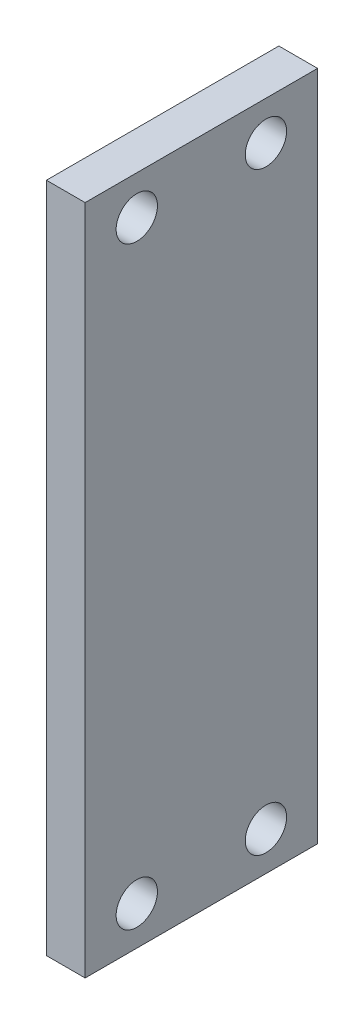
ISO-10303-21;
HEADER;
FILE_DESCRIPTION(('STEP AP214'),'2;1');
FILE_NAME('part.step','',(''),(''),'','','');
FILE_SCHEMA(('AUTOMOTIVE_DESIGN { 1 0 10303 214 1 1 1 1 }'));
ENDSEC;
DATA;
#1=APPLICATION_CONTEXT('core data for automotive mechanical design processes');
#2=APPLICATION_PROTOCOL_DEFINITION('international standard','automotive_design',2000,#1);
#3=PRODUCT_CONTEXT('',#1,'mechanical');
#4=PRODUCT('Part','Part','',(#3));
#5=PRODUCT_RELATED_PRODUCT_CATEGORY('part','',(#4));
#6=PRODUCT_DEFINITION_FORMATION('','',#4);
#7=PRODUCT_DEFINITION_CONTEXT('part definition',#1,'design');
#8=PRODUCT_DEFINITION('design','',#6,#7);
#9=PRODUCT_DEFINITION_SHAPE('','',#8);
#10=(LENGTH_UNIT() NAMED_UNIT(*) SI_UNIT(.MILLI.,.METRE.));
#11=(NAMED_UNIT(*) PLANE_ANGLE_UNIT() SI_UNIT($,.RADIAN.));
#12=(NAMED_UNIT(*) SI_UNIT($,.STERADIAN.) SOLID_ANGLE_UNIT());
#13=UNCERTAINTY_MEASURE_WITH_UNIT(LENGTH_MEASURE(1.E-05),#10,'distance_accuracy_value','');
#14=(GEOMETRIC_REPRESENTATION_CONTEXT(3) GLOBAL_UNCERTAINTY_ASSIGNED_CONTEXT((#13)) GLOBAL_UNIT_ASSIGNED_CONTEXT((#10,
#11,#12)) REPRESENTATION_CONTEXT('',''));
#15=CARTESIAN_POINT('',(0.,0.,0.));
#16=DIRECTION('',(0.,0.,1.));
#17=DIRECTION('',(1.,0.,0.));
#18=AXIS2_PLACEMENT_3D('',#15,#16,#17);
#19=CARTESIAN_POINT('',(123.988696823,-49.005118759,19.));
#20=DIRECTION('',(0.,0.,1.));
#21=DIRECTION('',(1.,0.,0.));
#22=AXIS2_PLACEMENT_3D('',#19,#20,#21);
#23=PLANE('',#22);
#24=DIRECTION('',(0.,1.,0.));
#25=VECTOR('',#24,1.);
#26=CARTESIAN_POINT('',(120.988696823,-75.005118759,19.));
#27=LINE('',#26,#25);
#28=CARTESIAN_POINT('',(120.988696823,-75.005118759,19.));
#29=VERTEX_POINT('',#28);
#30=CARTESIAN_POINT('',(120.988696823,-23.005118759,19.));
#31=VERTEX_POINT('',#30);
#32=EDGE_CURVE('E11',#29,#31,#27,.T.);
#33=ORIENTED_EDGE('',*,*,#32,.T.);
#34=DIRECTION('',(-1.,0.,0.));
#35=VECTOR('',#34,1.);
#36=CARTESIAN_POINT('',(123.988696823,-23.005118759,19.));
#37=LINE('',#36,#35);
#38=CARTESIAN_POINT('',(123.988696823,-23.005118759,19.));
#39=VERTEX_POINT('',#38);
#40=EDGE_CURVE('E42',#39,#31,#37,.T.);
#41=ORIENTED_EDGE('',*,*,#40,.F.);
#42=DIRECTION('',(0.,1.,0.));
#43=VECTOR('',#42,1.);
#44=CARTESIAN_POINT('',(123.988696823,-75.005118759,19.));
#45=LINE('',#44,#43);
#46=CARTESIAN_POINT('',(123.988696823,-75.005118759,19.));
#47=VERTEX_POINT('',#46);
#48=EDGE_CURVE('E156',#47,#39,#45,.T.);
#49=ORIENTED_EDGE('',*,*,#48,.F.);
#50=DIRECTION('',(-1.,0.,0.));
#51=VECTOR('',#50,1.);
#52=CARTESIAN_POINT('',(123.988696823,-75.005118759,19.));
#53=LINE('',#52,#51);
#54=EDGE_CURVE('E48',#47,#29,#53,.T.);
#55=ORIENTED_EDGE('',*,*,#54,.T.);
#56=EDGE_LOOP('',(#33,#41,#49,#55));
#57=FACE_BOUND('',#56,.T.);
#58=ADVANCED_FACE('F38',(#57),#23,.F.);
#59=CARTESIAN_POINT('',(123.988696823,-23.005118759,28.));
#60=DIRECTION('',(0.,-1.,0.));
#61=DIRECTION('',(0.,0.,-1.));
#62=AXIS2_PLACEMENT_3D('',#59,#60,#61);
#63=PLANE('',#62);
#64=DIRECTION('',(0.,0.,1.));
#65=VECTOR('',#64,1.);
#66=CARTESIAN_POINT('',(120.988696823,-23.005118759,19.));
#67=LINE('',#66,#65);
#68=CARTESIAN_POINT('',(120.988696823,-23.005118759,37.));
#69=VERTEX_POINT('',#68);
#70=EDGE_CURVE('E203',#31,#69,#67,.T.);
#71=ORIENTED_EDGE('',*,*,#70,.T.);
#72=DIRECTION('',(-1.,0.,0.));
#73=VECTOR('',#72,1.);
#74=CARTESIAN_POINT('',(123.988696823,-23.005118759,37.));
#75=LINE('',#74,#73);
#76=CARTESIAN_POINT('',(123.988696823,-23.005118759,37.));
#77=VERTEX_POINT('',#76);
#78=EDGE_CURVE('E116',#77,#69,#75,.T.);
#79=ORIENTED_EDGE('',*,*,#78,.F.);
#80=DIRECTION('',(0.,0.,1.));
#81=VECTOR('',#80,1.);
#82=CARTESIAN_POINT('',(123.988696823,-23.005118759,19.));
#83=LINE('',#82,#81);
#84=EDGE_CURVE('E121',#39,#77,#83,.T.);
#85=ORIENTED_EDGE('',*,*,#84,.F.);
#86=ORIENTED_EDGE('',*,*,#40,.T.);
#87=EDGE_LOOP('',(#71,#79,#85,#86));
#88=FACE_BOUND('',#87,.T.);
#89=ADVANCED_FACE('F232',(#88),#63,.F.);
#90=CARTESIAN_POINT('',(123.988696823,-49.005118759,37.));
#91=DIRECTION('',(0.,0.,1.));
#92=DIRECTION('',(1.,0.,0.));
#93=AXIS2_PLACEMENT_3D('',#90,#91,#92);
#94=PLANE('',#93);
#95=DIRECTION('',(0.,1.,0.));
#96=VECTOR('',#95,1.);
#97=CARTESIAN_POINT('',(120.988696823,-75.005118759,37.));
#98=LINE('',#97,#96);
#99=CARTESIAN_POINT('',(120.988696823,-75.005118759,37.));
#100=VERTEX_POINT('',#99);
#101=EDGE_CURVE('E150',#100,#69,#98,.T.);
#102=ORIENTED_EDGE('',*,*,#101,.F.);
#103=DIRECTION('',(-1.,0.,0.));
#104=VECTOR('',#103,1.);
#105=CARTESIAN_POINT('',(123.988696823,-75.005118759,37.));
#106=LINE('',#105,#104);
#107=CARTESIAN_POINT('',(123.988696823,-75.005118759,37.));
#108=VERTEX_POINT('',#107);
#109=EDGE_CURVE('E147',#108,#100,#106,.T.);
#110=ORIENTED_EDGE('',*,*,#109,.F.);
#111=DIRECTION('',(0.,1.,0.));
#112=VECTOR('',#111,1.);
#113=CARTESIAN_POINT('',(123.988696823,-75.005118759,37.));
#114=LINE('',#113,#112);
#115=EDGE_CURVE('E148',#108,#77,#114,.T.);
#116=ORIENTED_EDGE('',*,*,#115,.T.);
#117=ORIENTED_EDGE('',*,*,#78,.T.);
#118=EDGE_LOOP('',(#102,#110,#116,#117));
#119=FACE_BOUND('',#118,.T.);
#120=ADVANCED_FACE('F40',(#119),#94,.T.);
#121=CARTESIAN_POINT('',(123.988696823,-26.005118759,23.));
#122=DIRECTION('',(-1.,0.,0.));
#123=DIRECTION('',(0.,0.,1.));
#124=AXIS2_PLACEMENT_3D('',#121,#122,#123);
#125=CYLINDRICAL_SURFACE('',#124,1.6);
#126=DIRECTION('',(1.,0.,0.));
#127=VECTOR('',#126,1.);
#128=CARTESIAN_POINT('',(120.988696823,-26.005118759,24.6));
#129=LINE('',#128,#127);
#130=CARTESIAN_POINT('',(120.988696823,-26.005118759,24.6));
#131=VERTEX_POINT('',#130);
#132=CARTESIAN_POINT('',(123.988696823,-26.005118759,24.6));
#133=VERTEX_POINT('',#132);
#134=EDGE_CURVE('E201',#131,#133,#129,.T.);
#135=ORIENTED_EDGE('',*,*,#134,.F.);
#136=CARTESIAN_POINT('',(120.988696823,-26.005118759,23.));
#137=DIRECTION('',(1.,0.,0.));
#138=DIRECTION('',(0.,0.,-1.));
#139=AXIS2_PLACEMENT_3D('',#136,#137,#138);
#140=CIRCLE('',#139,1.6);
#141=CARTESIAN_POINT('',(120.988696823,-26.005118759,21.4));
#142=VERTEX_POINT('',#141);
#143=EDGE_CURVE('E135',#142,#131,#140,.T.);
#144=ORIENTED_EDGE('',*,*,#143,.F.);
#145=CARTESIAN_POINT('',(120.988696823,-26.005118759,23.));
#146=DIRECTION('',(1.,0.,0.));
#147=DIRECTION('',(0.,0.,-1.));
#148=AXIS2_PLACEMENT_3D('',#145,#146,#147);
#149=CIRCLE('',#148,1.6);
#150=EDGE_CURVE('E210',#131,#142,#149,.T.);
#151=ORIENTED_EDGE('',*,*,#150,.F.);
#152=ORIENTED_EDGE('',*,*,#134,.T.);
#153=CARTESIAN_POINT('',(123.988696823,-26.005118759,23.));
#154=DIRECTION('',(1.,0.,0.));
#155=DIRECTION('',(0.,0.,-1.));
#156=AXIS2_PLACEMENT_3D('',#153,#154,#155);
#157=CIRCLE('',#156,1.6);
#158=CARTESIAN_POINT('',(123.988696823,-26.005118759,21.4));
#159=VERTEX_POINT('',#158);
#160=EDGE_CURVE('E141',#133,#159,#157,.T.);
#161=ORIENTED_EDGE('',*,*,#160,.T.);
#162=CARTESIAN_POINT('',(123.988696823,-26.005118759,23.));
#163=DIRECTION('',(1.,0.,0.));
#164=DIRECTION('',(0.,0.,-1.));
#165=AXIS2_PLACEMENT_3D('',#162,#163,#164);
#166=CIRCLE('',#165,1.6);
#167=EDGE_CURVE('E185',#159,#133,#166,.T.);
#168=ORIENTED_EDGE('',*,*,#167,.T.);
#169=EDGE_LOOP('',(#135,#144,#151,#152,#161,#168));
#170=FACE_BOUND('',#169,.T.);
#171=ADVANCED_FACE('F216',(#170),#125,.F.);
#172=CARTESIAN_POINT('',(123.988696823,-26.005118759,33.));
#173=DIRECTION('',(-1.,0.,0.));
#174=DIRECTION('',(0.,0.,1.));
#175=AXIS2_PLACEMENT_3D('',#172,#173,#174);
#176=CYLINDRICAL_SURFACE('',#175,1.6);
#177=DIRECTION('',(1.,0.,0.));
#178=VECTOR('',#177,1.);
#179=CARTESIAN_POINT('',(120.988696823,-26.005118759,34.6));
#180=LINE('',#179,#178);
#181=CARTESIAN_POINT('',(120.988696823,-26.005118759,34.6));
#182=VERTEX_POINT('',#181);
#183=CARTESIAN_POINT('',(123.988696823,-26.005118759,34.6));
#184=VERTEX_POINT('',#183);
#185=EDGE_CURVE('E178',#182,#184,#180,.T.);
#186=ORIENTED_EDGE('',*,*,#185,.F.);
#187=CARTESIAN_POINT('',(120.988696823,-26.005118759,33.));
#188=DIRECTION('',(1.,0.,0.));
#189=DIRECTION('',(0.,0.,-1.));
#190=AXIS2_PLACEMENT_3D('',#187,#188,#189);
#191=CIRCLE('',#190,1.6);
#192=CARTESIAN_POINT('',(120.988696823,-26.005118759,31.4));
#193=VERTEX_POINT('',#192);
#194=EDGE_CURVE('E180',#193,#182,#191,.T.);
#195=ORIENTED_EDGE('',*,*,#194,.F.);
#196=CARTESIAN_POINT('',(120.988696823,-26.005118759,33.));
#197=DIRECTION('',(1.,0.,0.));
#198=DIRECTION('',(0.,0.,-1.));
#199=AXIS2_PLACEMENT_3D('',#196,#197,#198);
#200=CIRCLE('',#199,1.6);
#201=EDGE_CURVE('E183',#182,#193,#200,.T.);
#202=ORIENTED_EDGE('',*,*,#201,.F.);
#203=ORIENTED_EDGE('',*,*,#185,.T.);
#204=CARTESIAN_POINT('',(123.988696823,-26.005118759,33.));
#205=DIRECTION('',(1.,0.,0.));
#206=DIRECTION('',(0.,0.,-1.));
#207=AXIS2_PLACEMENT_3D('',#204,#205,#206);
#208=CIRCLE('',#207,1.6);
#209=CARTESIAN_POINT('',(123.988696823,-26.005118759,31.4));
#210=VERTEX_POINT('',#209);
#211=EDGE_CURVE('E176',#184,#210,#208,.T.);
#212=ORIENTED_EDGE('',*,*,#211,.T.);
#213=CARTESIAN_POINT('',(123.988696823,-26.005118759,33.));
#214=DIRECTION('',(1.,0.,0.));
#215=DIRECTION('',(0.,0.,-1.));
#216=AXIS2_PLACEMENT_3D('',#213,#214,#215);
#217=CIRCLE('',#216,1.6);
#218=EDGE_CURVE('E179',#210,#184,#217,.T.);
#219=ORIENTED_EDGE('',*,*,#218,.T.);
#220=EDGE_LOOP('',(#186,#195,#202,#203,#212,#219));
#221=FACE_BOUND('',#220,.T.);
#222=ADVANCED_FACE('F241',(#221),#176,.F.);
#223=CARTESIAN_POINT('',(123.988696823,-72.005118759,23.));
#224=DIRECTION('',(-1.,0.,0.));
#225=DIRECTION('',(0.,0.,1.));
#226=AXIS2_PLACEMENT_3D('',#223,#224,#225);
#227=CYLINDRICAL_SURFACE('',#226,1.6);
#228=DIRECTION('',(1.,0.,0.));
#229=VECTOR('',#228,1.);
#230=CARTESIAN_POINT('',(120.988696823,-72.005118759,24.6));
#231=LINE('',#230,#229);
#232=CARTESIAN_POINT('',(120.988696823,-72.005118759,24.6));
#233=VERTEX_POINT('',#232);
#234=CARTESIAN_POINT('',(123.988696823,-72.005118759,24.6));
#235=VERTEX_POINT('',#234);
#236=EDGE_CURVE('E191',#233,#235,#231,.T.);
#237=ORIENTED_EDGE('',*,*,#236,.F.);
#238=CARTESIAN_POINT('',(120.988696823,-72.005118759,23.));
#239=DIRECTION('',(1.,0.,0.));
#240=DIRECTION('',(0.,0.,-1.));
#241=AXIS2_PLACEMENT_3D('',#238,#239,#240);
#242=CIRCLE('',#241,1.6);
#243=CARTESIAN_POINT('',(120.988696823,-72.005118759,21.4));
#244=VERTEX_POINT('',#243);
#245=EDGE_CURVE('E99',#244,#233,#242,.T.);
#246=ORIENTED_EDGE('',*,*,#245,.F.);
#247=CARTESIAN_POINT('',(120.988696823,-72.005118759,23.));
#248=DIRECTION('',(1.,0.,0.));
#249=DIRECTION('',(0.,0.,-1.));
#250=AXIS2_PLACEMENT_3D('',#247,#248,#249);
#251=CIRCLE('',#250,1.6);
#252=EDGE_CURVE('E182',#233,#244,#251,.T.);
#253=ORIENTED_EDGE('',*,*,#252,.F.);
#254=ORIENTED_EDGE('',*,*,#236,.T.);
#255=CARTESIAN_POINT('',(123.988696823,-72.005118759,23.));
#256=DIRECTION('',(1.,0.,0.));
#257=DIRECTION('',(0.,0.,-1.));
#258=AXIS2_PLACEMENT_3D('',#255,#256,#257);
#259=CIRCLE('',#258,1.6);
#260=CARTESIAN_POINT('',(123.988696823,-72.005118759,21.4));
#261=VERTEX_POINT('',#260);
#262=EDGE_CURVE('E106',#235,#261,#259,.T.);
#263=ORIENTED_EDGE('',*,*,#262,.T.);
#264=CARTESIAN_POINT('',(123.988696823,-72.005118759,23.));
#265=DIRECTION('',(1.,0.,0.));
#266=DIRECTION('',(0.,0.,-1.));
#267=AXIS2_PLACEMENT_3D('',#264,#265,#266);
#268=CIRCLE('',#267,1.6);
#269=EDGE_CURVE('E169',#261,#235,#268,.T.);
#270=ORIENTED_EDGE('',*,*,#269,.T.);
#271=EDGE_LOOP('',(#237,#246,#253,#254,#263,#270));
#272=FACE_BOUND('',#271,.T.);
#273=ADVANCED_FACE('F243',(#272),#227,.F.);
#274=CARTESIAN_POINT('',(123.988696823,-72.005118759,33.));
#275=DIRECTION('',(-1.,0.,0.));
#276=DIRECTION('',(0.,0.,1.));
#277=AXIS2_PLACEMENT_3D('',#274,#275,#276);
#278=CYLINDRICAL_SURFACE('',#277,1.6);
#279=DIRECTION('',(1.,0.,0.));
#280=VECTOR('',#279,1.);
#281=CARTESIAN_POINT('',(120.988696823,-72.005118759,34.6));
#282=LINE('',#281,#280);
#283=CARTESIAN_POINT('',(120.988696823,-72.005118759,34.6));
#284=VERTEX_POINT('',#283);
#285=CARTESIAN_POINT('',(123.988696823,-72.005118759,34.6));
#286=VERTEX_POINT('',#285);
#287=EDGE_CURVE('E171',#284,#286,#282,.T.);
#288=ORIENTED_EDGE('',*,*,#287,.F.);
#289=CARTESIAN_POINT('',(120.988696823,-72.005118759,33.));
#290=DIRECTION('',(1.,0.,0.));
#291=DIRECTION('',(0.,0.,-1.));
#292=AXIS2_PLACEMENT_3D('',#289,#290,#291);
#293=CIRCLE('',#292,1.6);
#294=CARTESIAN_POINT('',(120.988696823,-72.005118759,31.4));
#295=VERTEX_POINT('',#294);
#296=EDGE_CURVE('E164',#295,#284,#293,.T.);
#297=ORIENTED_EDGE('',*,*,#296,.F.);
#298=CARTESIAN_POINT('',(120.988696823,-72.005118759,33.));
#299=DIRECTION('',(1.,0.,0.));
#300=DIRECTION('',(0.,0.,-1.));
#301=AXIS2_PLACEMENT_3D('',#298,#299,#300);
#302=CIRCLE('',#301,1.6);
#303=EDGE_CURVE('E166',#284,#295,#302,.T.);
#304=ORIENTED_EDGE('',*,*,#303,.F.);
#305=ORIENTED_EDGE('',*,*,#287,.T.);
#306=CARTESIAN_POINT('',(123.988696823,-72.005118759,33.));
#307=DIRECTION('',(1.,0.,0.));
#308=DIRECTION('',(0.,0.,-1.));
#309=AXIS2_PLACEMENT_3D('',#306,#307,#308);
#310=CIRCLE('',#309,1.6);
#311=CARTESIAN_POINT('',(123.988696823,-72.005118759,31.4));
#312=VERTEX_POINT('',#311);
#313=EDGE_CURVE('E173',#286,#312,#310,.T.);
#314=ORIENTED_EDGE('',*,*,#313,.T.);
#315=CARTESIAN_POINT('',(123.988696823,-72.005118759,33.));
#316=DIRECTION('',(1.,0.,0.));
#317=DIRECTION('',(0.,0.,-1.));
#318=AXIS2_PLACEMENT_3D('',#315,#316,#317);
#319=CIRCLE('',#318,1.6);
#320=EDGE_CURVE('E175',#312,#286,#319,.T.);
#321=ORIENTED_EDGE('',*,*,#320,.T.);
#322=EDGE_LOOP('',(#288,#297,#304,#305,#314,#321));
#323=FACE_BOUND('',#322,.T.);
#324=ADVANCED_FACE('F227',(#323),#278,.F.);
#325=CARTESIAN_POINT('',(123.988696823,-75.005118759,28.));
#326=DIRECTION('',(0.,1.,0.));
#327=DIRECTION('',(1.,0.,0.));
#328=AXIS2_PLACEMENT_3D('',#325,#326,#327);
#329=PLANE('',#328);
#330=DIRECTION('',(0.,0.,-1.));
#331=VECTOR('',#330,1.);
#332=CARTESIAN_POINT('',(120.988696823,-75.005118759,37.));
#333=LINE('',#332,#331);
#334=EDGE_CURVE('E155',#100,#29,#333,.T.);
#335=ORIENTED_EDGE('',*,*,#334,.T.);
#336=ORIENTED_EDGE('',*,*,#54,.F.);
#337=DIRECTION('',(0.,0.,-1.));
#338=VECTOR('',#337,1.);
#339=CARTESIAN_POINT('',(123.988696823,-75.005118759,37.));
#340=LINE('',#339,#338);
#341=EDGE_CURVE('E160',#108,#47,#340,.T.);
#342=ORIENTED_EDGE('',*,*,#341,.F.);
#343=ORIENTED_EDGE('',*,*,#109,.T.);
#344=EDGE_LOOP('',(#335,#336,#342,#343));
#345=FACE_BOUND('',#344,.T.);
#346=ADVANCED_FACE('F163',(#345),#329,.F.);
#347=CARTESIAN_POINT('',(123.988696823,-0.005118759,216.));
#348=DIRECTION('',(1.,0.,0.));
#349=DIRECTION('',(0.,1.,0.));
#350=AXIS2_PLACEMENT_3D('',#347,#348,#349);
#351=PLANE('',#350);
#352=ORIENTED_EDGE('',*,*,#313,.F.);
#353=ORIENTED_EDGE('',*,*,#320,.F.);
#354=EDGE_LOOP('',(#352,#353));
#355=FACE_BOUND('',#354,.T.);
#356=ORIENTED_EDGE('',*,*,#262,.F.);
#357=ORIENTED_EDGE('',*,*,#269,.F.);
#358=EDGE_LOOP('',(#356,#357));
#359=FACE_BOUND('',#358,.T.);
#360=ORIENTED_EDGE('',*,*,#211,.F.);
#361=ORIENTED_EDGE('',*,*,#218,.F.);
#362=EDGE_LOOP('',(#360,#361));
#363=FACE_BOUND('',#362,.T.);
#364=ORIENTED_EDGE('',*,*,#160,.F.);
#365=ORIENTED_EDGE('',*,*,#167,.F.);
#366=EDGE_LOOP('',(#364,#365));
#367=FACE_BOUND('',#366,.T.);
#368=ORIENTED_EDGE('',*,*,#48,.T.);
#369=ORIENTED_EDGE('',*,*,#84,.T.);
#370=ORIENTED_EDGE('',*,*,#115,.F.);
#371=ORIENTED_EDGE('',*,*,#341,.T.);
#372=EDGE_LOOP('',(#368,#369,#370,#371));
#373=FACE_BOUND('',#372,.T.);
#374=ADVANCED_FACE('F159',(#355,#359,#363,#367,#373),#351,.T.);
#375=CARTESIAN_POINT('',(120.988696823,-0.005118759,216.));
#376=DIRECTION('',(1.,0.,0.));
#377=DIRECTION('',(0.,1.,0.));
#378=AXIS2_PLACEMENT_3D('',#375,#376,#377);
#379=PLANE('',#378);
#380=ORIENTED_EDGE('',*,*,#296,.T.);
#381=ORIENTED_EDGE('',*,*,#303,.T.);
#382=EDGE_LOOP('',(#380,#381));
#383=FACE_BOUND('',#382,.T.);
#384=ORIENTED_EDGE('',*,*,#245,.T.);
#385=ORIENTED_EDGE('',*,*,#252,.T.);
#386=EDGE_LOOP('',(#384,#385));
#387=FACE_BOUND('',#386,.T.);
#388=ORIENTED_EDGE('',*,*,#194,.T.);
#389=ORIENTED_EDGE('',*,*,#201,.T.);
#390=EDGE_LOOP('',(#388,#389));
#391=FACE_BOUND('',#390,.T.);
#392=ORIENTED_EDGE('',*,*,#143,.T.);
#393=ORIENTED_EDGE('',*,*,#150,.T.);
#394=EDGE_LOOP('',(#392,#393));
#395=FACE_BOUND('',#394,.T.);
#396=ORIENTED_EDGE('',*,*,#32,.F.);
#397=ORIENTED_EDGE('',*,*,#334,.F.);
#398=ORIENTED_EDGE('',*,*,#101,.T.);
#399=ORIENTED_EDGE('',*,*,#70,.F.);
#400=EDGE_LOOP('',(#396,#397,#398,#399));
#401=FACE_BOUND('',#400,.T.);
#402=ADVANCED_FACE('F218',(#383,#387,#391,#395,#401),#379,.F.);
#403=CLOSED_SHELL('',(#58,#89,#120,#171,#222,#273,#324,#346,#374,#402));
#404=MANIFOLD_SOLID_BREP('B2',#403);
#405=ADVANCED_BREP_SHAPE_REPRESENTATION('',(#18,#404),#14);
#406=SHAPE_DEFINITION_REPRESENTATION(#9,#405);
ENDSEC;
END-ISO-10303-21;
